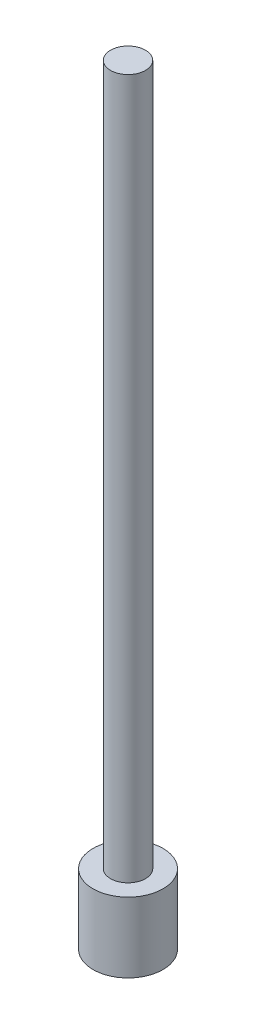
ISO-10303-21;
HEADER;
FILE_DESCRIPTION(('STEP AP214'),'2;1');
FILE_NAME('part.step','',(''),(''),'','','');
FILE_SCHEMA(('AUTOMOTIVE_DESIGN { 1 0 10303 214 1 1 1 1 }'));
ENDSEC;
DATA;
#1=APPLICATION_CONTEXT('core data for automotive mechanical design processes');
#2=APPLICATION_PROTOCOL_DEFINITION('international standard','automotive_design',2000,#1);
#3=PRODUCT_CONTEXT('',#1,'mechanical');
#4=PRODUCT('Part','Part','',(#3));
#5=PRODUCT_RELATED_PRODUCT_CATEGORY('part','',(#4));
#6=PRODUCT_DEFINITION_FORMATION('','',#4);
#7=PRODUCT_DEFINITION_CONTEXT('part definition',#1,'design');
#8=PRODUCT_DEFINITION('design','',#6,#7);
#9=PRODUCT_DEFINITION_SHAPE('','',#8);
#10=(LENGTH_UNIT() NAMED_UNIT(*) SI_UNIT(.MILLI.,.METRE.));
#11=(NAMED_UNIT(*) PLANE_ANGLE_UNIT() SI_UNIT($,.RADIAN.));
#12=(NAMED_UNIT(*) SI_UNIT($,.STERADIAN.) SOLID_ANGLE_UNIT());
#13=UNCERTAINTY_MEASURE_WITH_UNIT(LENGTH_MEASURE(1.E-05),#10,'distance_accuracy_value','');
#14=(GEOMETRIC_REPRESENTATION_CONTEXT(3) GLOBAL_UNCERTAINTY_ASSIGNED_CONTEXT((#13)) GLOBAL_UNIT_ASSIGNED_CONTEXT((#10,
#11,#12)) REPRESENTATION_CONTEXT('',''));
#15=CARTESIAN_POINT('',(0.,0.,0.));
#16=DIRECTION('',(0.,0.,1.));
#17=DIRECTION('',(1.,0.,0.));
#18=AXIS2_PLACEMENT_3D('',#15,#16,#17);
#19=CARTESIAN_POINT('',(0.,-1000.,0.));
#20=DIRECTION('',(0.,1.,0.));
#21=DIRECTION('',(0.,0.,1.));
#22=AXIS2_PLACEMENT_3D('',#19,#20,#21);
#23=CYLINDRICAL_SURFACE('',#22,25.);
#24=CARTESIAN_POINT('',(0.,-1000.,0.));
#25=DIRECTION('',(0.,1.,0.));
#26=DIRECTION('',(0.,0.,1.));
#27=AXIS2_PLACEMENT_3D('',#24,#25,#26);
#28=CIRCLE('',#27,25.);
#29=CARTESIAN_POINT('',(0.,-1000.,25.));
#30=VERTEX_POINT('',#29);
#31=EDGE_CURVE('E37',#30,#30,#28,.T.);
#32=ORIENTED_EDGE('',*,*,#31,.T.);
#33=EDGE_LOOP('',(#32));
#34=FACE_BOUND('',#33,.T.);
#35=CARTESIAN_POINT('',(0.,0.,0.));
#36=DIRECTION('',(0.,1.,0.));
#37=DIRECTION('',(0.,0.,1.));
#38=AXIS2_PLACEMENT_3D('',#35,#36,#37);
#39=CIRCLE('',#38,25.);
#40=CARTESIAN_POINT('',(0.,0.,25.));
#41=VERTEX_POINT('',#40);
#42=EDGE_CURVE('E10',#41,#41,#39,.T.);
#43=ORIENTED_EDGE('',*,*,#42,.F.);
#44=EDGE_LOOP('',(#43));
#45=FACE_BOUND('',#44,.T.);
#46=ADVANCED_FACE('F31',(#34,#45),#23,.T.);
#47=CARTESIAN_POINT('',(0.,0.,0.));
#48=DIRECTION('',(0.,1.,0.));
#49=DIRECTION('',(0.,0.,1.));
#50=AXIS2_PLACEMENT_3D('',#47,#48,#49);
#51=PLANE('',#50);
#52=ORIENTED_EDGE('',*,*,#42,.T.);
#53=EDGE_LOOP('',(#52));
#54=FACE_BOUND('',#53,.T.);
#55=ADVANCED_FACE('F65',(#54),#51,.T.);
#56=CARTESIAN_POINT('',(0.,-1100.,0.));
#57=DIRECTION('',(0.,1.,0.));
#58=DIRECTION('',(0.,0.,1.));
#59=AXIS2_PLACEMENT_3D('',#56,#57,#58);
#60=CYLINDRICAL_SURFACE('',#59,50.);
#61=CARTESIAN_POINT('',(0.,-1100.,0.));
#62=DIRECTION('',(0.,-1.,0.));
#63=DIRECTION('',(0.,0.,-1.));
#64=AXIS2_PLACEMENT_3D('',#61,#62,#63);
#65=CIRCLE('',#64,50.);
#66=CARTESIAN_POINT('',(0.,-1100.,-50.));
#67=VERTEX_POINT('',#66);
#68=EDGE_CURVE('E41',#67,#67,#65,.T.);
#69=ORIENTED_EDGE('',*,*,#68,.F.);
#70=EDGE_LOOP('',(#69));
#71=FACE_BOUND('',#70,.T.);
#72=CARTESIAN_POINT('',(0.,-1000.,0.));
#73=DIRECTION('',(0.,-1.,0.));
#74=DIRECTION('',(0.,0.,-1.));
#75=AXIS2_PLACEMENT_3D('',#72,#73,#74);
#76=CIRCLE('',#75,50.);
#77=CARTESIAN_POINT('',(0.,-1000.,-50.));
#78=VERTEX_POINT('',#77);
#79=EDGE_CURVE('E45',#78,#78,#76,.T.);
#80=ORIENTED_EDGE('',*,*,#79,.T.);
#81=EDGE_LOOP('',(#80));
#82=FACE_BOUND('',#81,.T.);
#83=ADVANCED_FACE('F51',(#71,#82),#60,.T.);
#84=CARTESIAN_POINT('',(0.,-1100.,0.));
#85=DIRECTION('',(0.,-1.,0.));
#86=DIRECTION('',(0.,0.,-1.));
#87=AXIS2_PLACEMENT_3D('',#84,#85,#86);
#88=PLANE('',#87);
#89=ORIENTED_EDGE('',*,*,#68,.T.);
#90=EDGE_LOOP('',(#89));
#91=FACE_BOUND('',#90,.T.);
#92=ADVANCED_FACE('F55',(#91),#88,.T.);
#93=CARTESIAN_POINT('',(0.,-1000.,0.));
#94=DIRECTION('',(0.,-1.,0.));
#95=DIRECTION('',(0.,0.,-1.));
#96=AXIS2_PLACEMENT_3D('',#93,#94,#95);
#97=PLANE('',#96);
#98=ORIENTED_EDGE('',*,*,#31,.F.);
#99=EDGE_LOOP('',(#98));
#100=FACE_BOUND('',#99,.T.);
#101=ORIENTED_EDGE('',*,*,#79,.F.);
#102=EDGE_LOOP('',(#101));
#103=FACE_BOUND('',#102,.T.);
#104=ADVANCED_FACE('F53',(#100,#103),#97,.F.);
#105=CLOSED_SHELL('',(#46,#55,#83,#92,#104));
#106=MANIFOLD_SOLID_BREP('B2',#105);
#107=ADVANCED_BREP_SHAPE_REPRESENTATION('',(#18,#106),#14);
#108=SHAPE_DEFINITION_REPRESENTATION(#9,#107);
ENDSEC;
END-ISO-10303-21;
